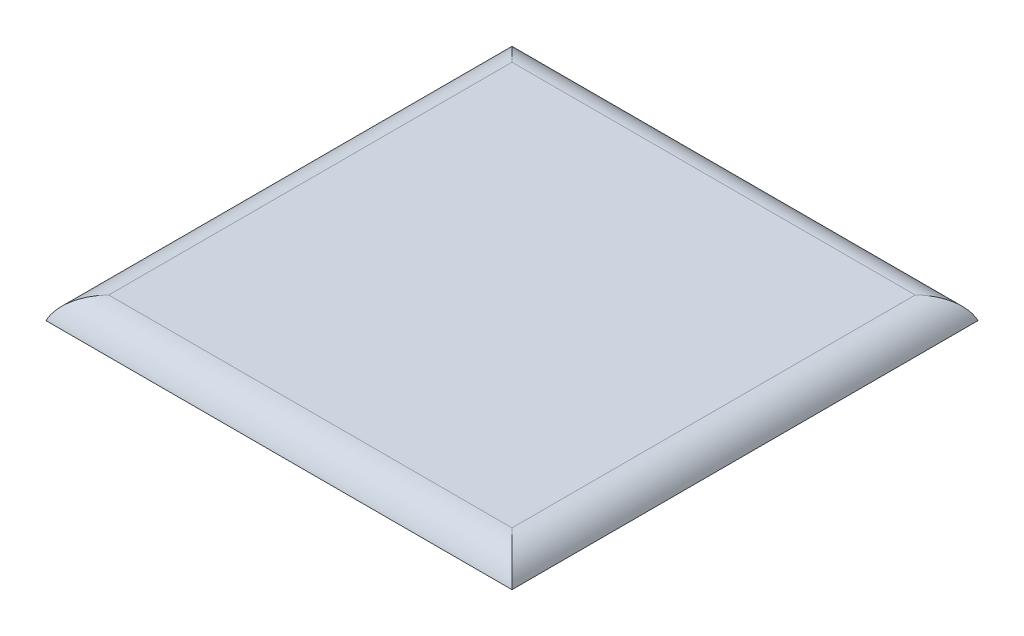
ISO-10303-21;
HEADER;
FILE_DESCRIPTION(('STEP AP214'),'2;1');
FILE_NAME('part.step','',(''),(''),'','','');
FILE_SCHEMA(('AUTOMOTIVE_DESIGN { 1 0 10303 214 1 1 1 1 }'));
ENDSEC;
DATA;
#1=APPLICATION_CONTEXT('core data for automotive mechanical design processes');
#2=APPLICATION_PROTOCOL_DEFINITION('international standard','automotive_design',2000,#1);
#3=PRODUCT_CONTEXT('',#1,'mechanical');
#4=PRODUCT('Part','Part','',(#3));
#5=PRODUCT_RELATED_PRODUCT_CATEGORY('part','',(#4));
#6=PRODUCT_DEFINITION_FORMATION('','',#4);
#7=PRODUCT_DEFINITION_CONTEXT('part definition',#1,'design');
#8=PRODUCT_DEFINITION('design','',#6,#7);
#9=PRODUCT_DEFINITION_SHAPE('','',#8);
#10=(LENGTH_UNIT() NAMED_UNIT(*) SI_UNIT(.MILLI.,.METRE.));
#11=(NAMED_UNIT(*) PLANE_ANGLE_UNIT() SI_UNIT($,.RADIAN.));
#12=(NAMED_UNIT(*) SI_UNIT($,.STERADIAN.) SOLID_ANGLE_UNIT());
#13=UNCERTAINTY_MEASURE_WITH_UNIT(LENGTH_MEASURE(1.E-05),#10,'distance_accuracy_value','');
#14=(GEOMETRIC_REPRESENTATION_CONTEXT(3) GLOBAL_UNCERTAINTY_ASSIGNED_CONTEXT((#13)) GLOBAL_UNIT_ASSIGNED_CONTEXT((#10,
#11,#12)) REPRESENTATION_CONTEXT('',''));
#15=CARTESIAN_POINT('',(0.,0.,0.));
#16=DIRECTION('',(0.,0.,1.));
#17=DIRECTION('',(1.,0.,0.));
#18=AXIS2_PLACEMENT_3D('',#15,#16,#17);
#19=CARTESIAN_POINT('',(0.,10.,0.));
#20=DIRECTION('',(0.,1.,0.));
#21=DIRECTION('',(0.,0.,1.));
#22=AXIS2_PLACEMENT_3D('',#19,#20,#21);
#23=PLANE('',#22);
#24=DIRECTION('',(-1.,0.,0.));
#25=VECTOR('',#24,1.);
#26=CARTESIAN_POINT('',(121.531914893617,10.,65.7472260783967));
#27=LINE('',#26,#25);
#28=CARTESIAN_POINT('',(-74.325949482652,10.,65.7472260783967));
#29=VERTEX_POINT('',#28);
#30=CARTESIAN_POINT('',(107.389779269886,10.,65.7472260783967));
#31=VERTEX_POINT('',#30);
#32=EDGE_CURVE('E104',#29,#31,#27,.F.);
#33=ORIENTED_EDGE('',*,*,#32,.T.);
#34=DIRECTION('',(0.,0.,-1.));
#35=VECTOR('',#34,1.);
#36=CARTESIAN_POINT('',(107.389779269886,10.,-130.110638297872));
#37=LINE('',#36,#35);
#38=CARTESIAN_POINT('',(107.389779269886,10.,-115.968502674141));
#39=VERTEX_POINT('',#38);
#40=EDGE_CURVE('E11',#31,#39,#37,.T.);
#41=ORIENTED_EDGE('',*,*,#40,.T.);
#42=DIRECTION('',(-1.,0.,0.));
#43=VECTOR('',#42,1.);
#44=CARTESIAN_POINT('',(-88.468085106383,10.,-115.968502674141));
#45=LINE('',#44,#43);
#46=CARTESIAN_POINT('',(-74.325949482652,10.,-115.968502674141));
#47=VERTEX_POINT('',#46);
#48=EDGE_CURVE('E48',#39,#47,#45,.T.);
#49=ORIENTED_EDGE('',*,*,#48,.T.);
#50=DIRECTION('',(0.,0.,-1.));
#51=VECTOR('',#50,1.);
#52=CARTESIAN_POINT('',(-74.325949482652,10.,79.8893617021277));
#53=LINE('',#52,#51);
#54=EDGE_CURVE('E106',#47,#29,#53,.F.);
#55=ORIENTED_EDGE('',*,*,#54,.T.);
#56=EDGE_LOOP('',(#33,#41,#49,#55));
#57=FACE_BOUND('',#56,.T.);
#58=ADVANCED_FACE('F39',(#57),#23,.T.);
#59=CARTESIAN_POINT('',(0.,0.,0.));
#60=DIRECTION('',(0.,1.,0.));
#61=DIRECTION('',(0.,0.,1.));
#62=AXIS2_PLACEMENT_3D('',#59,#60,#61);
#63=PLANE('',#62);
#64=DIRECTION('',(1.,0.,0.));
#65=VECTOR('',#64,1.);
#66=CARTESIAN_POINT('',(0.,0.,79.8893617021277));
#67=LINE('',#66,#65);
#68=CARTESIAN_POINT('',(-88.4680851063829,0.,79.8893617021277));
#69=VERTEX_POINT('',#68);
#70=CARTESIAN_POINT('',(121.531914893617,0.,79.8893617021277));
#71=VERTEX_POINT('',#70);
#72=EDGE_CURVE('E89',#69,#71,#67,.T.);
#73=ORIENTED_EDGE('',*,*,#72,.F.);
#74=DIRECTION('',(0.,0.,1.));
#75=VECTOR('',#74,1.);
#76=CARTESIAN_POINT('',(-88.4680851063829,0.,0.));
#77=LINE('',#76,#75);
#78=CARTESIAN_POINT('',(-88.468085106383,0.,-130.110638297872));
#79=VERTEX_POINT('',#78);
#80=EDGE_CURVE('E100',#79,#69,#77,.T.);
#81=ORIENTED_EDGE('',*,*,#80,.F.);
#82=DIRECTION('',(1.,0.,0.));
#83=VECTOR('',#82,1.);
#84=CARTESIAN_POINT('',(0.,0.,-130.110638297872));
#85=LINE('',#84,#83);
#86=CARTESIAN_POINT('',(121.531914893617,0.,-130.110638297872));
#87=VERTEX_POINT('',#86);
#88=EDGE_CURVE('E98',#79,#87,#85,.T.);
#89=ORIENTED_EDGE('',*,*,#88,.T.);
#90=DIRECTION('',(0.,0.,1.));
#91=VECTOR('',#90,1.);
#92=CARTESIAN_POINT('',(121.531914893617,0.,0.));
#93=LINE('',#92,#91);
#94=EDGE_CURVE('E84',#87,#71,#93,.T.);
#95=ORIENTED_EDGE('',*,*,#94,.T.);
#96=EDGE_LOOP('',(#73,#81,#89,#95));
#97=FACE_BOUND('',#96,.T.);
#98=ADVANCED_FACE('F96',(#97),#63,.F.);
#99=CARTESIAN_POINT('',(-74.325949482652,-5.,0.));
#100=DIRECTION('',(0.,0.,1.));
#101=DIRECTION('',(1.,0.,0.));
#102=AXIS2_PLACEMENT_3D('',#99,#100,#101);
#103=CYLINDRICAL_SURFACE('',#102,15.);
#104=CARTESIAN_POINT('',(-74.325949482652,-5.,65.7472260783967));
#105=DIRECTION('',(0.707106781186548,0.,0.707106781186547));
#106=DIRECTION('',(0.707106781186547,0.,-0.707106781186548));
#107=AXIS2_PLACEMENT_3D('',#104,#105,#106);
#108=ELLIPSE('',#107,21.2132034355964,15.);
#109=EDGE_CURVE('E92',#29,#69,#108,.T.);
#110=ORIENTED_EDGE('',*,*,#109,.F.);
#111=ORIENTED_EDGE('',*,*,#54,.F.);
#112=CARTESIAN_POINT('',(-74.325949482652,-5.,-115.968502674141));
#113=DIRECTION('',(-0.707106781186547,0.,0.707106781186548));
#114=DIRECTION('',(0.707106781186548,0.,0.707106781186547));
#115=AXIS2_PLACEMENT_3D('',#112,#113,#114);
#116=ELLIPSE('',#115,21.2132034355964,15.);
#117=EDGE_CURVE('E43',#79,#47,#116,.F.);
#118=ORIENTED_EDGE('',*,*,#117,.F.);
#119=ORIENTED_EDGE('',*,*,#80,.T.);
#120=EDGE_LOOP('',(#110,#111,#118,#119));
#121=FACE_BOUND('',#120,.T.);
#122=ADVANCED_FACE('F41',(#121),#103,.T.);
#123=CARTESIAN_POINT('',(0.,-5.,-115.968502674141));
#124=DIRECTION('',(1.,0.,0.));
#125=DIRECTION('',(0.,0.,-1.));
#126=AXIS2_PLACEMENT_3D('',#123,#124,#125);
#127=CYLINDRICAL_SURFACE('',#126,15.);
#128=ORIENTED_EDGE('',*,*,#117,.T.);
#129=ORIENTED_EDGE('',*,*,#48,.F.);
#130=CARTESIAN_POINT('',(107.389779269886,-5.,-115.968502674141));
#131=DIRECTION('',(0.707106781186547,0.,0.707106781186547));
#132=DIRECTION('',(0.707106781186547,0.,-0.707106781186548));
#133=AXIS2_PLACEMENT_3D('',#130,#131,#132);
#134=ELLIPSE('',#133,21.2132034355964,15.);
#135=EDGE_CURVE('E56',#87,#39,#134,.T.);
#136=ORIENTED_EDGE('',*,*,#135,.F.);
#137=ORIENTED_EDGE('',*,*,#88,.F.);
#138=EDGE_LOOP('',(#128,#129,#136,#137));
#139=FACE_BOUND('',#138,.T.);
#140=ADVANCED_FACE('F112',(#139),#127,.T.);
#141=CARTESIAN_POINT('',(0.,-5.,65.7472260783967));
#142=DIRECTION('',(1.,0.,0.));
#143=DIRECTION('',(0.,0.,-1.));
#144=AXIS2_PLACEMENT_3D('',#141,#142,#143);
#145=CYLINDRICAL_SURFACE('',#144,15.);
#146=ORIENTED_EDGE('',*,*,#109,.T.);
#147=ORIENTED_EDGE('',*,*,#72,.T.);
#148=CARTESIAN_POINT('',(107.389779269886,-5.,65.7472260783967));
#149=DIRECTION('',(0.707106781186547,0.,-0.707106781186548));
#150=DIRECTION('',(0.707106781186547,0.,0.707106781186547));
#151=AXIS2_PLACEMENT_3D('',#148,#149,#150);
#152=ELLIPSE('',#151,21.2132034355964,15.);
#153=EDGE_CURVE('E80',#31,#71,#152,.T.);
#154=ORIENTED_EDGE('',*,*,#153,.F.);
#155=ORIENTED_EDGE('',*,*,#32,.F.);
#156=EDGE_LOOP('',(#146,#147,#154,#155));
#157=FACE_BOUND('',#156,.T.);
#158=ADVANCED_FACE('F90',(#157),#145,.T.);
#159=CARTESIAN_POINT('',(107.389779269886,-5.,0.));
#160=DIRECTION('',(0.,0.,1.));
#161=DIRECTION('',(1.,0.,0.));
#162=AXIS2_PLACEMENT_3D('',#159,#160,#161);
#163=CYLINDRICAL_SURFACE('',#162,15.);
#164=ORIENTED_EDGE('',*,*,#135,.T.);
#165=ORIENTED_EDGE('',*,*,#40,.F.);
#166=ORIENTED_EDGE('',*,*,#153,.T.);
#167=ORIENTED_EDGE('',*,*,#94,.F.);
#168=EDGE_LOOP('',(#164,#165,#166,#167));
#169=FACE_BOUND('',#168,.T.);
#170=ADVANCED_FACE('F82',(#169),#163,.T.);
#171=CLOSED_SHELL('',(#58,#98,#122,#140,#158,#170));
#172=MANIFOLD_SOLID_BREP('B2',#171);
#173=ADVANCED_BREP_SHAPE_REPRESENTATION('',(#18,#172),#14);
#174=SHAPE_DEFINITION_REPRESENTATION(#9,#173);
ENDSEC;
END-ISO-10303-21;
